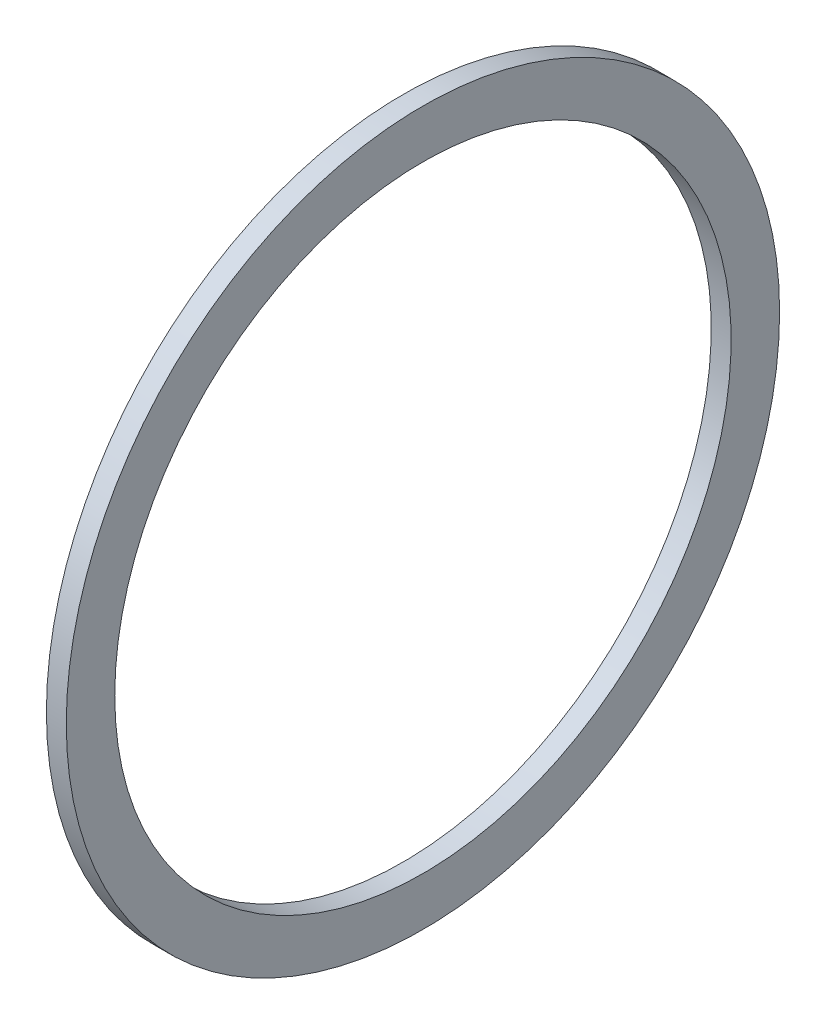
ISO-10303-21;
HEADER;
FILE_DESCRIPTION(('STEP AP214'),'2;1');
FILE_NAME('part.step','',(''),(''),'','','');
FILE_SCHEMA(('AUTOMOTIVE_DESIGN { 1 0 10303 214 1 1 1 1 }'));
ENDSEC;
DATA;
#1=APPLICATION_CONTEXT('core data for automotive mechanical design processes');
#2=APPLICATION_PROTOCOL_DEFINITION('international standard','automotive_design',2000,#1);
#3=PRODUCT_CONTEXT('',#1,'mechanical');
#4=PRODUCT('Part','Part','',(#3));
#5=PRODUCT_RELATED_PRODUCT_CATEGORY('part','',(#4));
#6=PRODUCT_DEFINITION_FORMATION('','',#4);
#7=PRODUCT_DEFINITION_CONTEXT('part definition',#1,'design');
#8=PRODUCT_DEFINITION('design','',#6,#7);
#9=PRODUCT_DEFINITION_SHAPE('','',#8);
#10=(LENGTH_UNIT() NAMED_UNIT(*) SI_UNIT(.MILLI.,.METRE.));
#11=(NAMED_UNIT(*) PLANE_ANGLE_UNIT() SI_UNIT($,.RADIAN.));
#12=(NAMED_UNIT(*) SI_UNIT($,.STERADIAN.) SOLID_ANGLE_UNIT());
#13=UNCERTAINTY_MEASURE_WITH_UNIT(LENGTH_MEASURE(1.E-05),#10,'distance_accuracy_value','');
#14=(GEOMETRIC_REPRESENTATION_CONTEXT(3) GLOBAL_UNCERTAINTY_ASSIGNED_CONTEXT((#13)) GLOBAL_UNIT_ASSIGNED_CONTEXT((#10,
#11,#12)) REPRESENTATION_CONTEXT('',''));
#15=CARTESIAN_POINT('',(0.,0.,0.));
#16=DIRECTION('',(0.,0.,1.));
#17=DIRECTION('',(1.,0.,0.));
#18=AXIS2_PLACEMENT_3D('',#15,#16,#17);
#19=CARTESIAN_POINT('',(0.,-31.496,0.));
#20=DIRECTION('',(-1.,0.,0.));
#21=DIRECTION('',(0.,0.,1.));
#22=AXIS2_PLACEMENT_3D('',#19,#20,#21);
#23=PLANE('',#22);
#24=CARTESIAN_POINT('',(0.,0.,0.));
#25=DIRECTION('',(-1.,0.,0.));
#26=DIRECTION('',(0.,0.,1.));
#27=AXIS2_PLACEMENT_3D('',#24,#25,#26);
#28=CIRCLE('',#27,36.449);
#29=CARTESIAN_POINT('',(0.,0.,36.449));
#30=VERTEX_POINT('',#29);
#31=EDGE_CURVE('E10',#30,#30,#28,.T.);
#32=ORIENTED_EDGE('',*,*,#31,.T.);
#33=EDGE_LOOP('',(#32));
#34=FACE_BOUND('',#33,.T.);
#35=CARTESIAN_POINT('',(0.,0.,0.));
#36=DIRECTION('',(-1.,0.,0.));
#37=DIRECTION('',(0.,0.,1.));
#38=AXIS2_PLACEMENT_3D('',#35,#36,#37);
#39=CIRCLE('',#38,31.496);
#40=CARTESIAN_POINT('',(0.,0.,31.496));
#41=VERTEX_POINT('',#40);
#42=EDGE_CURVE('E43',#41,#41,#39,.T.);
#43=ORIENTED_EDGE('',*,*,#42,.F.);
#44=EDGE_LOOP('',(#43));
#45=FACE_BOUND('',#44,.T.);
#46=ADVANCED_FACE('F29',(#34,#45),#23,.T.);
#47=CARTESIAN_POINT('',(-43.7165807560137,0.,0.));
#48=DIRECTION('',(-1.,0.,0.));
#49=DIRECTION('',(0.,0.,1.));
#50=AXIS2_PLACEMENT_3D('',#47,#48,#49);
#51=CYLINDRICAL_SURFACE('',#50,36.449);
#52=CARTESIAN_POINT('',(2.032,0.,0.));
#53=DIRECTION('',(-1.,0.,0.));
#54=DIRECTION('',(0.,0.,1.));
#55=AXIS2_PLACEMENT_3D('',#52,#53,#54);
#56=CIRCLE('',#55,36.449);
#57=CARTESIAN_POINT('',(2.032,0.,36.449));
#58=VERTEX_POINT('',#57);
#59=EDGE_CURVE('E35',#58,#58,#56,.T.);
#60=ORIENTED_EDGE('',*,*,#59,.T.);
#61=EDGE_LOOP('',(#60));
#62=FACE_BOUND('',#61,.T.);
#63=ORIENTED_EDGE('',*,*,#31,.F.);
#64=EDGE_LOOP('',(#63));
#65=FACE_BOUND('',#64,.T.);
#66=ADVANCED_FACE('F53',(#62,#65),#51,.T.);
#67=CARTESIAN_POINT('',(2.032,-31.496,0.));
#68=DIRECTION('',(1.,0.,0.));
#69=DIRECTION('',(0.,0.,-1.));
#70=AXIS2_PLACEMENT_3D('',#67,#68,#69);
#71=PLANE('',#70);
#72=CARTESIAN_POINT('',(2.032,0.,0.));
#73=DIRECTION('',(-1.,0.,0.));
#74=DIRECTION('',(0.,0.,1.));
#75=AXIS2_PLACEMENT_3D('',#72,#73,#74);
#76=CIRCLE('',#75,31.496);
#77=CARTESIAN_POINT('',(2.032,0.,31.496));
#78=VERTEX_POINT('',#77);
#79=EDGE_CURVE('E39',#78,#78,#76,.T.);
#80=ORIENTED_EDGE('',*,*,#79,.T.);
#81=EDGE_LOOP('',(#80));
#82=FACE_BOUND('',#81,.T.);
#83=ORIENTED_EDGE('',*,*,#59,.F.);
#84=EDGE_LOOP('',(#83));
#85=FACE_BOUND('',#84,.T.);
#86=ADVANCED_FACE('F57',(#82,#85),#71,.T.);
#87=CARTESIAN_POINT('',(-43.7165807560137,0.,0.));
#88=DIRECTION('',(-1.,0.,0.));
#89=DIRECTION('',(0.,0.,1.));
#90=AXIS2_PLACEMENT_3D('',#87,#88,#89);
#91=CYLINDRICAL_SURFACE('',#90,31.496);
#92=ORIENTED_EDGE('',*,*,#42,.T.);
#93=EDGE_LOOP('',(#92));
#94=FACE_BOUND('',#93,.T.);
#95=ORIENTED_EDGE('',*,*,#79,.F.);
#96=EDGE_LOOP('',(#95));
#97=FACE_BOUND('',#96,.T.);
#98=ADVANCED_FACE('F49',(#94,#97),#91,.F.);
#99=CLOSED_SHELL('',(#46,#66,#86,#98));
#100=MANIFOLD_SOLID_BREP('B2',#99);
#101=ADVANCED_BREP_SHAPE_REPRESENTATION('',(#18,#100),#14);
#102=SHAPE_DEFINITION_REPRESENTATION(#9,#101);
ENDSEC;
END-ISO-10303-21;
